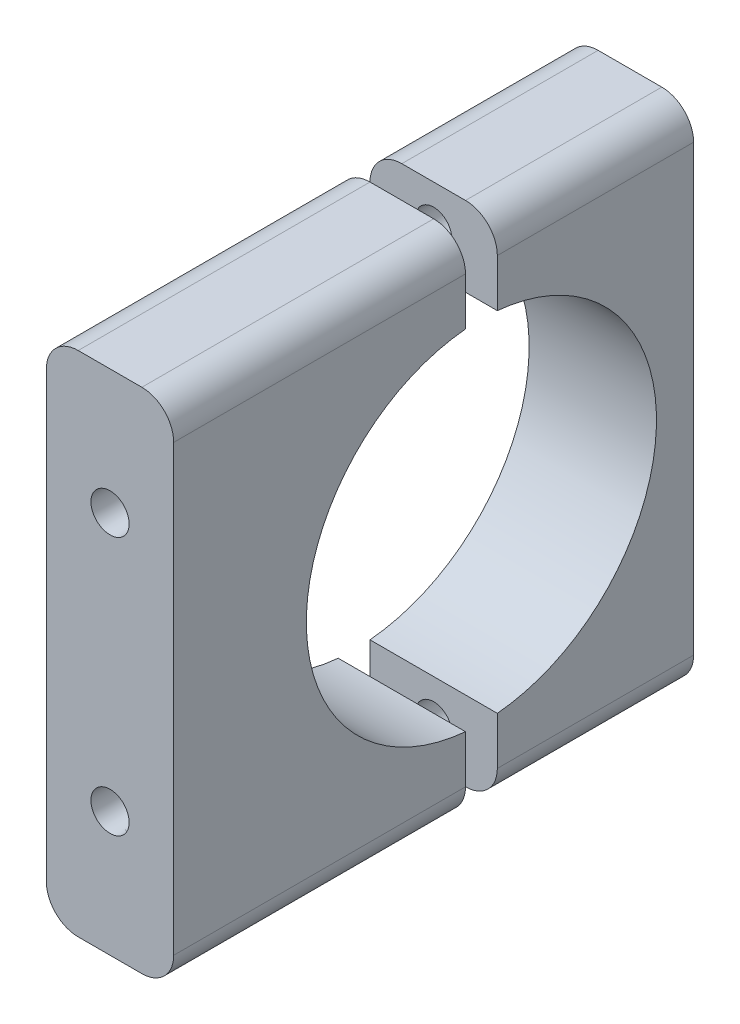
ISO-10303-21;
HEADER;
FILE_DESCRIPTION(('STEP AP214'),'2;1');
FILE_NAME('part.step','',(''),(''),'','','');
FILE_SCHEMA(('AUTOMOTIVE_DESIGN { 1 0 10303 214 1 1 1 1 }'));
ENDSEC;
DATA;
#1=APPLICATION_CONTEXT('core data for automotive mechanical design processes');
#2=APPLICATION_PROTOCOL_DEFINITION('international standard','automotive_design',2000,#1);
#3=PRODUCT_CONTEXT('',#1,'mechanical');
#4=PRODUCT('Part','Part','',(#3));
#5=PRODUCT_RELATED_PRODUCT_CATEGORY('part','',(#4));
#6=PRODUCT_DEFINITION_FORMATION('','',#4);
#7=PRODUCT_DEFINITION_CONTEXT('part definition',#1,'design');
#8=PRODUCT_DEFINITION('design','',#6,#7);
#9=PRODUCT_DEFINITION_SHAPE('','',#8);
#10=(LENGTH_UNIT() NAMED_UNIT(*) SI_UNIT(.MILLI.,.METRE.));
#11=(NAMED_UNIT(*) PLANE_ANGLE_UNIT() SI_UNIT($,.RADIAN.));
#12=(NAMED_UNIT(*) SI_UNIT($,.STERADIAN.) SOLID_ANGLE_UNIT());
#13=UNCERTAINTY_MEASURE_WITH_UNIT(LENGTH_MEASURE(1.E-05),#10,'distance_accuracy_value','');
#14=(GEOMETRIC_REPRESENTATION_CONTEXT(3) GLOBAL_UNCERTAINTY_ASSIGNED_CONTEXT((#13)) GLOBAL_UNIT_ASSIGNED_CONTEXT((#10,
#11,#12)) REPRESENTATION_CONTEXT('',''));
#15=CARTESIAN_POINT('',(0.,0.,0.));
#16=DIRECTION('',(0.,0.,1.));
#17=DIRECTION('',(1.,0.,0.));
#18=AXIS2_PLACEMENT_3D('',#15,#16,#17);
#19=CARTESIAN_POINT('',(12.,0.,1.5));
#20=DIRECTION('',(0.,0.,1.));
#21=DIRECTION('',(0.,-1.,0.));
#22=AXIS2_PLACEMENT_3D('',#19,#20,#21);
#23=PLANE('',#22);
#24=DIRECTION('',(0.,1.,0.));
#25=VECTOR('',#24,1.);
#26=CARTESIAN_POINT('',(12.,0.,1.5));
#27=LINE('',#26,#25);
#28=CARTESIAN_POINT('',(12.,-20.931676725155,1.5));
#29=VERTEX_POINT('',#28);
#30=CARTESIAN_POINT('',(12.,-16.431676725155,1.5));
#31=VERTEX_POINT('',#30);
#32=EDGE_CURVE('E156',#29,#31,#27,.T.);
#33=ORIENTED_EDGE('',*,*,#32,.F.);
#34=CARTESIAN_POINT('',(9.,-20.931676725155,1.5));
#35=DIRECTION('',(0.,0.,1.));
#36=DIRECTION('',(0.,-1.,0.));
#37=AXIS2_PLACEMENT_3D('',#34,#35,#36);
#38=CIRCLE('',#37,3.);
#39=CARTESIAN_POINT('',(9.,-23.931676725155,1.5));
#40=VERTEX_POINT('',#39);
#41=EDGE_CURVE('E74',#29,#40,#38,.F.);
#42=ORIENTED_EDGE('',*,*,#41,.T.);
#43=DIRECTION('',(-1.,0.,0.));
#44=VECTOR('',#43,1.);
#45=CARTESIAN_POINT('',(12.,-23.931676725155,1.5));
#46=LINE('',#45,#44);
#47=CARTESIAN_POINT('',(3.,-23.931676725155,1.5));
#48=VERTEX_POINT('',#47);
#49=EDGE_CURVE('E177',#40,#48,#46,.T.);
#50=ORIENTED_EDGE('',*,*,#49,.T.);
#51=CARTESIAN_POINT('',(3.,-20.931676725155,1.5));
#52=DIRECTION('',(0.,0.,1.));
#53=DIRECTION('',(0.,-1.,0.));
#54=AXIS2_PLACEMENT_3D('',#51,#52,#53);
#55=CIRCLE('',#54,3.);
#56=CARTESIAN_POINT('',(0.,-20.931676725155,1.5));
#57=VERTEX_POINT('',#56);
#58=EDGE_CURVE('E66',#48,#57,#55,.F.);
#59=ORIENTED_EDGE('',*,*,#58,.T.);
#60=DIRECTION('',(0.,1.,0.));
#61=VECTOR('',#60,1.);
#62=CARTESIAN_POINT('',(0.,0.,1.5));
#63=LINE('',#62,#61);
#64=CARTESIAN_POINT('',(0.,-16.431676725155,1.5));
#65=VERTEX_POINT('',#64);
#66=EDGE_CURVE('E158',#57,#65,#63,.T.);
#67=ORIENTED_EDGE('',*,*,#66,.T.);
#68=DIRECTION('',(-1.,0.,0.));
#69=VECTOR('',#68,1.);
#70=CARTESIAN_POINT('',(12.,-16.431676725155,1.5));
#71=LINE('',#70,#69);
#72=EDGE_CURVE('E169',#31,#65,#71,.T.);
#73=ORIENTED_EDGE('',*,*,#72,.F.);
#74=EDGE_LOOP('',(#33,#42,#50,#59,#67,#73));
#75=FACE_BOUND('',#74,.T.);
#76=CARTESIAN_POINT('',(6.,-20.181676725155,1.5));
#77=DIRECTION('',(0.,0.,-1.));
#78=DIRECTION('',(0.,1.,0.));
#79=AXIS2_PLACEMENT_3D('',#76,#77,#78);
#80=CIRCLE('',#79,1.80000000000001);
#81=CARTESIAN_POINT('',(6.,-18.381676725155,1.5));
#82=VERTEX_POINT('',#81);
#83=EDGE_CURVE('E163',#82,#82,#80,.T.);
#84=ORIENTED_EDGE('',*,*,#83,.F.);
#85=EDGE_LOOP('',(#84));
#86=FACE_BOUND('',#85,.T.);
#87=ADVANCED_FACE('F49',(#75,#86),#23,.F.);
#88=CARTESIAN_POINT('',(12.,0.,0.));
#89=DIRECTION('',(-1.,0.,0.));
#90=DIRECTION('',(0.,0.,1.));
#91=AXIS2_PLACEMENT_3D('',#88,#89,#90);
#92=CYLINDRICAL_SURFACE('',#91,16.5);
#93=CARTESIAN_POINT('',(0.,0.,0.));
#94=DIRECTION('',(1.,0.,0.));
#95=DIRECTION('',(0.,0.,-1.));
#96=AXIS2_PLACEMENT_3D('',#93,#94,#95);
#97=CIRCLE('',#96,16.5);
#98=CARTESIAN_POINT('',(0.,16.431676725155,1.5));
#99=VERTEX_POINT('',#98);
#100=EDGE_CURVE('E136',#99,#65,#97,.T.);
#101=ORIENTED_EDGE('',*,*,#100,.F.);
#102=DIRECTION('',(-1.,0.,0.));
#103=VECTOR('',#102,1.);
#104=CARTESIAN_POINT('',(12.,16.431676725155,1.5));
#105=LINE('',#104,#103);
#106=CARTESIAN_POINT('',(12.,16.431676725155,1.5));
#107=VERTEX_POINT('',#106);
#108=EDGE_CURVE('E129',#107,#99,#105,.T.);
#109=ORIENTED_EDGE('',*,*,#108,.F.);
#110=CARTESIAN_POINT('',(12.,0.,0.));
#111=DIRECTION('',(1.,0.,0.));
#112=DIRECTION('',(0.,0.,-1.));
#113=AXIS2_PLACEMENT_3D('',#110,#111,#112);
#114=CIRCLE('',#113,16.5);
#115=EDGE_CURVE('E134',#107,#31,#114,.T.);
#116=ORIENTED_EDGE('',*,*,#115,.T.);
#117=ORIENTED_EDGE('',*,*,#72,.T.);
#118=EDGE_LOOP('',(#101,#109,#116,#117));
#119=FACE_BOUND('',#118,.T.);
#120=ADVANCED_FACE('F131',(#119),#92,.F.);
#121=CARTESIAN_POINT('',(12.,0.,1.5));
#122=DIRECTION('',(0.,0.,1.));
#123=DIRECTION('',(0.,-1.,0.));
#124=AXIS2_PLACEMENT_3D('',#121,#122,#123);
#125=PLANE('',#124);
#126=CARTESIAN_POINT('',(6.,20.181676725155,1.5));
#127=DIRECTION('',(0.,0.,-1.));
#128=DIRECTION('',(0.,1.,0.));
#129=AXIS2_PLACEMENT_3D('',#126,#127,#128);
#130=CIRCLE('',#129,1.80000000000001);
#131=CARTESIAN_POINT('',(6.,21.981676725155,1.5));
#132=VERTEX_POINT('',#131);
#133=EDGE_CURVE('E217',#132,#132,#130,.T.);
#134=ORIENTED_EDGE('',*,*,#133,.F.);
#135=EDGE_LOOP('',(#134));
#136=FACE_BOUND('',#135,.T.);
#137=DIRECTION('',(-1.,0.,0.));
#138=VECTOR('',#137,1.);
#139=CARTESIAN_POINT('',(12.,23.931676725155,1.5));
#140=LINE('',#139,#138);
#141=CARTESIAN_POINT('',(9.,23.931676725155,1.5));
#142=VERTEX_POINT('',#141);
#143=CARTESIAN_POINT('',(3.,23.931676725155,1.5));
#144=VERTEX_POINT('',#143);
#145=EDGE_CURVE('E141',#142,#144,#140,.T.);
#146=ORIENTED_EDGE('',*,*,#145,.F.);
#147=CARTESIAN_POINT('',(9.,20.931676725155,1.5));
#148=DIRECTION('',(0.,0.,1.));
#149=DIRECTION('',(0.,-1.,0.));
#150=AXIS2_PLACEMENT_3D('',#147,#148,#149);
#151=CIRCLE('',#150,3.);
#152=CARTESIAN_POINT('',(12.,20.931676725155,1.5));
#153=VERTEX_POINT('',#152);
#154=EDGE_CURVE('E148',#142,#153,#151,.F.);
#155=ORIENTED_EDGE('',*,*,#154,.T.);
#156=DIRECTION('',(0.,1.,0.));
#157=VECTOR('',#156,1.);
#158=CARTESIAN_POINT('',(12.,0.,1.5));
#159=LINE('',#158,#157);
#160=EDGE_CURVE('E144',#107,#153,#159,.T.);
#161=ORIENTED_EDGE('',*,*,#160,.F.);
#162=ORIENTED_EDGE('',*,*,#108,.T.);
#163=DIRECTION('',(0.,1.,0.));
#164=VECTOR('',#163,1.);
#165=CARTESIAN_POINT('',(0.,0.,1.5));
#166=LINE('',#165,#164);
#167=CARTESIAN_POINT('',(0.,20.931676725155,1.5));
#168=VERTEX_POINT('',#167);
#169=EDGE_CURVE('E171',#99,#168,#166,.T.);
#170=ORIENTED_EDGE('',*,*,#169,.T.);
#171=CARTESIAN_POINT('',(3.,20.931676725155,1.5));
#172=DIRECTION('',(0.,0.,1.));
#173=DIRECTION('',(0.,-1.,0.));
#174=AXIS2_PLACEMENT_3D('',#171,#172,#173);
#175=CIRCLE('',#174,3.);
#176=EDGE_CURVE('E203',#168,#144,#175,.F.);
#177=ORIENTED_EDGE('',*,*,#176,.T.);
#178=EDGE_LOOP('',(#146,#155,#161,#162,#170,#177));
#179=FACE_BOUND('',#178,.T.);
#180=ADVANCED_FACE('F146',(#136,#179),#125,.F.);
#181=CARTESIAN_POINT('',(12.,23.931676725155,0.));
#182=DIRECTION('',(0.,-1.,0.));
#183=DIRECTION('',(0.,0.,-1.));
#184=AXIS2_PLACEMENT_3D('',#181,#182,#183);
#185=PLANE('',#184);
#186=DIRECTION('',(-1.,0.,0.));
#187=VECTOR('',#186,1.);
#188=CARTESIAN_POINT('',(12.,23.931676725155,29.));
#189=LINE('',#188,#187);
#190=CARTESIAN_POINT('',(9.,23.931676725155,29.));
#191=VERTEX_POINT('',#190);
#192=CARTESIAN_POINT('',(3.,23.931676725155,29.));
#193=VERTEX_POINT('',#192);
#194=EDGE_CURVE('E182',#191,#193,#189,.T.);
#195=ORIENTED_EDGE('',*,*,#194,.F.);
#196=DIRECTION('',(0.,0.,1.));
#197=VECTOR('',#196,1.);
#198=CARTESIAN_POINT('',(9.,23.931676725155,1.5));
#199=LINE('',#198,#197);
#200=EDGE_CURVE('E201',#191,#142,#199,.F.);
#201=ORIENTED_EDGE('',*,*,#200,.T.);
#202=ORIENTED_EDGE('',*,*,#145,.T.);
#203=DIRECTION('',(0.,0.,1.));
#204=VECTOR('',#203,1.);
#205=CARTESIAN_POINT('',(3.,23.931676725155,0.));
#206=LINE('',#205,#204);
#207=EDGE_CURVE('E198',#144,#193,#206,.T.);
#208=ORIENTED_EDGE('',*,*,#207,.T.);
#209=EDGE_LOOP('',(#195,#201,#202,#208));
#210=FACE_BOUND('',#209,.T.);
#211=ADVANCED_FACE('F239',(#210),#185,.F.);
#212=CARTESIAN_POINT('',(12.,0.,29.));
#213=DIRECTION('',(0.,0.,-1.));
#214=DIRECTION('',(-1.,0.,0.));
#215=AXIS2_PLACEMENT_3D('',#212,#213,#214);
#216=PLANE('',#215);
#217=CARTESIAN_POINT('',(6.,12.181676725155,29.));
#218=DIRECTION('',(0.,0.,1.));
#219=DIRECTION('',(1.,0.,0.));
#220=AXIS2_PLACEMENT_3D('',#217,#218,#219);
#221=CIRCLE('',#220,1.80000000000001);
#222=CARTESIAN_POINT('',(7.80000000000002,12.181676725155,29.));
#223=VERTEX_POINT('',#222);
#224=EDGE_CURVE('E229',#223,#223,#221,.T.);
#225=ORIENTED_EDGE('',*,*,#224,.F.);
#226=EDGE_LOOP('',(#225));
#227=FACE_BOUND('',#226,.T.);
#228=CARTESIAN_POINT('',(6.,-12.181676725155,29.));
#229=DIRECTION('',(0.,0.,1.));
#230=DIRECTION('',(1.,0.,0.));
#231=AXIS2_PLACEMENT_3D('',#228,#229,#230);
#232=CIRCLE('',#231,1.80000000000001);
#233=CARTESIAN_POINT('',(7.80000000000002,-12.181676725155,29.));
#234=VERTEX_POINT('',#233);
#235=EDGE_CURVE('E220',#234,#234,#232,.T.);
#236=ORIENTED_EDGE('',*,*,#235,.F.);
#237=EDGE_LOOP('',(#236));
#238=FACE_BOUND('',#237,.T.);
#239=DIRECTION('',(0.,-1.,0.));
#240=VECTOR('',#239,1.);
#241=CARTESIAN_POINT('',(12.,0.,29.));
#242=LINE('',#241,#240);
#243=CARTESIAN_POINT('',(12.,20.931676725155,29.));
#244=VERTEX_POINT('',#243);
#245=CARTESIAN_POINT('',(12.,-20.931676725155,29.));
#246=VERTEX_POINT('',#245);
#247=EDGE_CURVE('E152',#244,#246,#242,.T.);
#248=ORIENTED_EDGE('',*,*,#247,.F.);
#249=CARTESIAN_POINT('',(9.,20.931676725155,29.));
#250=DIRECTION('',(0.,0.,-1.));
#251=DIRECTION('',(-1.,0.,0.));
#252=AXIS2_PLACEMENT_3D('',#249,#250,#251);
#253=CIRCLE('',#252,3.);
#254=EDGE_CURVE('E196',#244,#191,#253,.F.);
#255=ORIENTED_EDGE('',*,*,#254,.T.);
#256=ORIENTED_EDGE('',*,*,#194,.T.);
#257=CARTESIAN_POINT('',(3.,20.931676725155,29.));
#258=DIRECTION('',(0.,0.,-1.));
#259=DIRECTION('',(-1.,0.,0.));
#260=AXIS2_PLACEMENT_3D('',#257,#258,#259);
#261=CIRCLE('',#260,3.);
#262=CARTESIAN_POINT('',(0.,20.931676725155,29.));
#263=VERTEX_POINT('',#262);
#264=EDGE_CURVE('E190',#193,#263,#261,.F.);
#265=ORIENTED_EDGE('',*,*,#264,.T.);
#266=DIRECTION('',(0.,-1.,0.));
#267=VECTOR('',#266,1.);
#268=CARTESIAN_POINT('',(0.,0.,29.));
#269=LINE('',#268,#267);
#270=CARTESIAN_POINT('',(0.,-20.931676725155,29.));
#271=VERTEX_POINT('',#270);
#272=EDGE_CURVE('E160',#263,#271,#269,.T.);
#273=ORIENTED_EDGE('',*,*,#272,.T.);
#274=CARTESIAN_POINT('',(3.,-20.931676725155,29.));
#275=DIRECTION('',(0.,0.,-1.));
#276=DIRECTION('',(-1.,0.,0.));
#277=AXIS2_PLACEMENT_3D('',#274,#275,#276);
#278=CIRCLE('',#277,3.);
#279=CARTESIAN_POINT('',(3.,-23.931676725155,29.));
#280=VERTEX_POINT('',#279);
#281=EDGE_CURVE('E192',#271,#280,#278,.F.);
#282=ORIENTED_EDGE('',*,*,#281,.T.);
#283=DIRECTION('',(-1.,0.,0.));
#284=VECTOR('',#283,1.);
#285=CARTESIAN_POINT('',(12.,-23.931676725155,29.));
#286=LINE('',#285,#284);
#287=CARTESIAN_POINT('',(9.,-23.931676725155,29.));
#288=VERTEX_POINT('',#287);
#289=EDGE_CURVE('E179',#288,#280,#286,.T.);
#290=ORIENTED_EDGE('',*,*,#289,.F.);
#291=CARTESIAN_POINT('',(9.,-20.931676725155,29.));
#292=DIRECTION('',(0.,0.,-1.));
#293=DIRECTION('',(-1.,0.,0.));
#294=AXIS2_PLACEMENT_3D('',#291,#292,#293);
#295=CIRCLE('',#294,3.);
#296=EDGE_CURVE('E194',#288,#246,#295,.F.);
#297=ORIENTED_EDGE('',*,*,#296,.T.);
#298=EDGE_LOOP('',(#248,#255,#256,#265,#273,#282,#290,#297));
#299=FACE_BOUND('',#298,.T.);
#300=ADVANCED_FACE('F235',(#227,#238,#299),#216,.F.);
#301=CARTESIAN_POINT('',(12.,-23.931676725155,0.));
#302=DIRECTION('',(0.,1.,0.));
#303=DIRECTION('',(0.,0.,1.));
#304=AXIS2_PLACEMENT_3D('',#301,#302,#303);
#305=PLANE('',#304);
#306=ORIENTED_EDGE('',*,*,#49,.F.);
#307=DIRECTION('',(0.,0.,-1.));
#308=VECTOR('',#307,1.);
#309=CARTESIAN_POINT('',(9.,-23.931676725155,29.));
#310=LINE('',#309,#308);
#311=EDGE_CURVE('E210',#40,#288,#310,.F.);
#312=ORIENTED_EDGE('',*,*,#311,.T.);
#313=ORIENTED_EDGE('',*,*,#289,.T.);
#314=DIRECTION('',(0.,0.,-1.));
#315=VECTOR('',#314,1.);
#316=CARTESIAN_POINT('',(3.,-23.931676725155,0.));
#317=LINE('',#316,#315);
#318=EDGE_CURVE('E208',#280,#48,#317,.T.);
#319=ORIENTED_EDGE('',*,*,#318,.T.);
#320=EDGE_LOOP('',(#306,#312,#313,#319));
#321=FACE_BOUND('',#320,.T.);
#322=ADVANCED_FACE('F238',(#321),#305,.F.);
#323=CARTESIAN_POINT('',(12.,0.,0.));
#324=DIRECTION('',(1.,0.,0.));
#325=DIRECTION('',(0.,0.,-1.));
#326=AXIS2_PLACEMENT_3D('',#323,#324,#325);
#327=PLANE('',#326);
#328=ORIENTED_EDGE('',*,*,#160,.T.);
#329=DIRECTION('',(0.,0.,1.));
#330=VECTOR('',#329,1.);
#331=CARTESIAN_POINT('',(12.,20.931676725155,29.));
#332=LINE('',#331,#330);
#333=EDGE_CURVE('E188',#153,#244,#332,.T.);
#334=ORIENTED_EDGE('',*,*,#333,.T.);
#335=ORIENTED_EDGE('',*,*,#247,.T.);
#336=DIRECTION('',(0.,0.,-1.));
#337=VECTOR('',#336,1.);
#338=CARTESIAN_POINT('',(12.,-20.931676725155,1.5));
#339=LINE('',#338,#337);
#340=EDGE_CURVE('E140',#246,#29,#339,.T.);
#341=ORIENTED_EDGE('',*,*,#340,.T.);
#342=ORIENTED_EDGE('',*,*,#32,.T.);
#343=ORIENTED_EDGE('',*,*,#115,.F.);
#344=EDGE_LOOP('',(#328,#334,#335,#341,#342,#343));
#345=FACE_BOUND('',#344,.T.);
#346=ADVANCED_FACE('F154',(#345),#327,.T.);
#347=CARTESIAN_POINT('',(0.,0.,0.));
#348=DIRECTION('',(1.,0.,0.));
#349=DIRECTION('',(0.,0.,-1.));
#350=AXIS2_PLACEMENT_3D('',#347,#348,#349);
#351=PLANE('',#350);
#352=ORIENTED_EDGE('',*,*,#66,.F.);
#353=DIRECTION('',(0.,0.,-1.));
#354=VECTOR('',#353,1.);
#355=CARTESIAN_POINT('',(0.,-20.931676725155,0.));
#356=LINE('',#355,#354);
#357=EDGE_CURVE('E12',#57,#271,#356,.F.);
#358=ORIENTED_EDGE('',*,*,#357,.T.);
#359=ORIENTED_EDGE('',*,*,#272,.F.);
#360=DIRECTION('',(0.,0.,1.));
#361=VECTOR('',#360,1.);
#362=CARTESIAN_POINT('',(0.,20.931676725155,0.));
#363=LINE('',#362,#361);
#364=EDGE_CURVE('E58',#263,#168,#363,.F.);
#365=ORIENTED_EDGE('',*,*,#364,.T.);
#366=ORIENTED_EDGE('',*,*,#169,.F.);
#367=ORIENTED_EDGE('',*,*,#100,.T.);
#368=EDGE_LOOP('',(#352,#358,#359,#365,#366,#367));
#369=FACE_BOUND('',#368,.T.);
#370=ADVANCED_FACE('F257',(#369),#351,.F.);
#371=CARTESIAN_POINT('',(9.,20.931676725155,0.));
#372=DIRECTION('',(0.,0.,-1.));
#373=DIRECTION('',(-1.,0.,0.));
#374=AXIS2_PLACEMENT_3D('',#371,#372,#373);
#375=CYLINDRICAL_SURFACE('',#374,3.);
#376=ORIENTED_EDGE('',*,*,#154,.F.);
#377=ORIENTED_EDGE('',*,*,#200,.F.);
#378=ORIENTED_EDGE('',*,*,#254,.F.);
#379=ORIENTED_EDGE('',*,*,#333,.F.);
#380=EDGE_LOOP('',(#376,#377,#378,#379));
#381=FACE_BOUND('',#380,.T.);
#382=ADVANCED_FACE('F266',(#381),#375,.T.);
#383=CARTESIAN_POINT('',(9.,-20.931676725155,0.));
#384=DIRECTION('',(0.,0.,1.));
#385=DIRECTION('',(1.,0.,0.));
#386=AXIS2_PLACEMENT_3D('',#383,#384,#385);
#387=CYLINDRICAL_SURFACE('',#386,3.);
#388=ORIENTED_EDGE('',*,*,#296,.F.);
#389=ORIENTED_EDGE('',*,*,#311,.F.);
#390=ORIENTED_EDGE('',*,*,#41,.F.);
#391=ORIENTED_EDGE('',*,*,#340,.F.);
#392=EDGE_LOOP('',(#388,#389,#390,#391));
#393=FACE_BOUND('',#392,.T.);
#394=ADVANCED_FACE('F248',(#393),#387,.T.);
#395=CARTESIAN_POINT('',(3.,-20.931676725155,0.));
#396=DIRECTION('',(0.,0.,-1.));
#397=DIRECTION('',(-1.,0.,0.));
#398=AXIS2_PLACEMENT_3D('',#395,#396,#397);
#399=CYLINDRICAL_SURFACE('',#398,3.);
#400=ORIENTED_EDGE('',*,*,#281,.F.);
#401=ORIENTED_EDGE('',*,*,#357,.F.);
#402=ORIENTED_EDGE('',*,*,#58,.F.);
#403=ORIENTED_EDGE('',*,*,#318,.F.);
#404=EDGE_LOOP('',(#400,#401,#402,#403));
#405=FACE_BOUND('',#404,.T.);
#406=ADVANCED_FACE('F253',(#405),#399,.T.);
#407=CARTESIAN_POINT('',(3.,20.931676725155,0.));
#408=DIRECTION('',(0.,0.,1.));
#409=DIRECTION('',(1.,0.,0.));
#410=AXIS2_PLACEMENT_3D('',#407,#408,#409);
#411=CYLINDRICAL_SURFACE('',#410,3.);
#412=ORIENTED_EDGE('',*,*,#176,.F.);
#413=ORIENTED_EDGE('',*,*,#364,.F.);
#414=ORIENTED_EDGE('',*,*,#264,.F.);
#415=ORIENTED_EDGE('',*,*,#207,.F.);
#416=EDGE_LOOP('',(#412,#413,#414,#415));
#417=FACE_BOUND('',#416,.T.);
#418=ADVANCED_FACE('F262',(#417),#411,.T.);
#419=CARTESIAN_POINT('',(6.,-20.181676725155,7.5));
#420=DIRECTION('',(0.,0.,1.));
#421=DIRECTION('',(0.,-1.,0.));
#422=AXIS2_PLACEMENT_3D('',#419,#420,#421);
#423=PLANE('',#422);
#424=CARTESIAN_POINT('',(6.,-20.181676725155,7.5));
#425=DIRECTION('',(0.,0.,1.));
#426=DIRECTION('',(0.,-1.,0.));
#427=AXIS2_PLACEMENT_3D('',#424,#425,#426);
#428=CIRCLE('',#427,1.59047538304953);
#429=CARTESIAN_POINT('',(6.,-21.7721521082045,7.5));
#430=VERTEX_POINT('',#429);
#431=EDGE_CURVE('E172',#430,#430,#428,.F.);
#432=ORIENTED_EDGE('',*,*,#431,.T.);
#433=EDGE_LOOP('',(#432));
#434=FACE_BOUND('',#433,.T.);
#435=ADVANCED_FACE('F326',(#434),#423,.F.);
#436=CARTESIAN_POINT('',(6.,-20.181676725155,1.5));
#437=DIRECTION('',(0.,0.,-1.));
#438=DIRECTION('',(0.,1.,0.));
#439=AXIS2_PLACEMENT_3D('',#436,#437,#438);
#440=CONICAL_SURFACE('',#439,1.80000000000001,0.0349065850398866);
#441=ORIENTED_EDGE('',*,*,#431,.F.);
#442=EDGE_LOOP('',(#441));
#443=FACE_BOUND('',#442,.T.);
#444=ORIENTED_EDGE('',*,*,#83,.T.);
#445=EDGE_LOOP('',(#444));
#446=FACE_BOUND('',#445,.T.);
#447=ADVANCED_FACE('F307',(#443,#446),#440,.F.);
#448=CARTESIAN_POINT('',(6.,20.181676725155,7.5));
#449=DIRECTION('',(0.,0.,1.));
#450=DIRECTION('',(0.,-1.,0.));
#451=AXIS2_PLACEMENT_3D('',#448,#449,#450);
#452=PLANE('',#451);
#453=CARTESIAN_POINT('',(6.,20.181676725155,7.5));
#454=DIRECTION('',(0.,0.,1.));
#455=DIRECTION('',(0.,-1.,0.));
#456=AXIS2_PLACEMENT_3D('',#453,#454,#455);
#457=CIRCLE('',#456,1.59047538304953);
#458=CARTESIAN_POINT('',(6.,18.5912013421055,7.5));
#459=VERTEX_POINT('',#458);
#460=EDGE_CURVE('E215',#459,#459,#457,.F.);
#461=ORIENTED_EDGE('',*,*,#460,.T.);
#462=EDGE_LOOP('',(#461));
#463=FACE_BOUND('',#462,.T.);
#464=ADVANCED_FACE('F298',(#463),#452,.F.);
#465=CARTESIAN_POINT('',(6.,20.181676725155,1.5));
#466=DIRECTION('',(0.,0.,-1.));
#467=DIRECTION('',(0.,1.,0.));
#468=AXIS2_PLACEMENT_3D('',#465,#466,#467);
#469=CONICAL_SURFACE('',#468,1.80000000000001,0.0349065850398866);
#470=ORIENTED_EDGE('',*,*,#460,.F.);
#471=EDGE_LOOP('',(#470));
#472=FACE_BOUND('',#471,.T.);
#473=ORIENTED_EDGE('',*,*,#133,.T.);
#474=EDGE_LOOP('',(#473));
#475=FACE_BOUND('',#474,.T.);
#476=ADVANCED_FACE('F295',(#472,#475),#469,.F.);
#477=CARTESIAN_POINT('',(6.,-12.181676725155,23.));
#478=DIRECTION('',(0.,0.,-1.));
#479=DIRECTION('',(-1.,0.,0.));
#480=AXIS2_PLACEMENT_3D('',#477,#478,#479);
#481=PLANE('',#480);
#482=CARTESIAN_POINT('',(6.,-12.181676725155,23.));
#483=DIRECTION('',(0.,0.,-1.));
#484=DIRECTION('',(-1.,0.,0.));
#485=AXIS2_PLACEMENT_3D('',#482,#483,#484);
#486=CIRCLE('',#485,1.59047538304953);
#487=CARTESIAN_POINT('',(4.40952461695048,-12.181676725155,23.));
#488=VERTEX_POINT('',#487);
#489=EDGE_CURVE('E218',#488,#488,#486,.F.);
#490=ORIENTED_EDGE('',*,*,#489,.T.);
#491=EDGE_LOOP('',(#490));
#492=FACE_BOUND('',#491,.T.);
#493=ADVANCED_FACE('F297',(#492),#481,.F.);
#494=CARTESIAN_POINT('',(6.,-12.181676725155,29.));
#495=DIRECTION('',(0.,0.,1.));
#496=DIRECTION('',(1.,0.,0.));
#497=AXIS2_PLACEMENT_3D('',#494,#495,#496);
#498=CONICAL_SURFACE('',#497,1.80000000000001,0.0349065850398866);
#499=ORIENTED_EDGE('',*,*,#489,.F.);
#500=EDGE_LOOP('',(#499));
#501=FACE_BOUND('',#500,.T.);
#502=ORIENTED_EDGE('',*,*,#235,.T.);
#503=EDGE_LOOP('',(#502));
#504=FACE_BOUND('',#503,.T.);
#505=ADVANCED_FACE('F305',(#501,#504),#498,.F.);
#506=CARTESIAN_POINT('',(6.,12.181676725155,23.));
#507=DIRECTION('',(0.,0.,-1.));
#508=DIRECTION('',(-1.,0.,0.));
#509=AXIS2_PLACEMENT_3D('',#506,#507,#508);
#510=PLANE('',#509);
#511=CARTESIAN_POINT('',(6.,12.181676725155,23.));
#512=DIRECTION('',(0.,0.,-1.));
#513=DIRECTION('',(-1.,0.,0.));
#514=AXIS2_PLACEMENT_3D('',#511,#512,#513);
#515=CIRCLE('',#514,1.59047538304953);
#516=CARTESIAN_POINT('',(4.40952461695048,12.181676725155,23.));
#517=VERTEX_POINT('',#516);
#518=EDGE_CURVE('E53',#517,#517,#515,.F.);
#519=ORIENTED_EDGE('',*,*,#518,.T.);
#520=EDGE_LOOP('',(#519));
#521=FACE_BOUND('',#520,.T.);
#522=ADVANCED_FACE('F314',(#521),#510,.F.);
#523=CARTESIAN_POINT('',(6.,12.181676725155,29.));
#524=DIRECTION('',(0.,0.,1.));
#525=DIRECTION('',(1.,0.,0.));
#526=AXIS2_PLACEMENT_3D('',#523,#524,#525);
#527=CONICAL_SURFACE('',#526,1.80000000000001,0.0349065850398866);
#528=ORIENTED_EDGE('',*,*,#518,.F.);
#529=EDGE_LOOP('',(#528));
#530=FACE_BOUND('',#529,.T.);
#531=ORIENTED_EDGE('',*,*,#224,.T.);
#532=EDGE_LOOP('',(#531));
#533=FACE_BOUND('',#532,.T.);
#534=ADVANCED_FACE('F51',(#530,#533),#527,.F.);
#535=CLOSED_SHELL('',(#87,#120,#180,#211,#300,#322,#346,#370,#382,#394,#406,#418,#435,#447,#464,
#476,#493,#505,#522,#534));
#536=MANIFOLD_SOLID_BREP('B2',#535);
#537=CARTESIAN_POINT('',(12.,0.,0.));
#538=DIRECTION('',(-1.,0.,0.));
#539=DIRECTION('',(0.,0.,1.));
#540=AXIS2_PLACEMENT_3D('',#537,#538,#539);
#541=CYLINDRICAL_SURFACE('',#540,16.5);
#542=CARTESIAN_POINT('',(0.,0.,0.));
#543=DIRECTION('',(1.,0.,0.));
#544=DIRECTION('',(0.,0.,-1.));
#545=AXIS2_PLACEMENT_3D('',#542,#543,#544);
#546=CIRCLE('',#545,16.5);
#547=CARTESIAN_POINT('',(0.,-16.431676725155,-1.5));
#548=VERTEX_POINT('',#547);
#549=CARTESIAN_POINT('',(0.,16.431676725155,-1.5));
#550=VERTEX_POINT('',#549);
#551=EDGE_CURVE('E573',#548,#550,#546,.T.);
#552=ORIENTED_EDGE('',*,*,#551,.F.);
#553=DIRECTION('',(-1.,0.,0.));
#554=VECTOR('',#553,1.);
#555=CARTESIAN_POINT('',(12.,-16.431676725155,-1.5));
#556=LINE('',#555,#554);
#557=CARTESIAN_POINT('',(12.,-16.431676725155,-1.5));
#558=VERTEX_POINT('',#557);
#559=EDGE_CURVE('E567',#558,#548,#556,.T.);
#560=ORIENTED_EDGE('',*,*,#559,.F.);
#561=CARTESIAN_POINT('',(12.,0.,0.));
#562=DIRECTION('',(1.,0.,0.));
#563=DIRECTION('',(0.,0.,-1.));
#564=AXIS2_PLACEMENT_3D('',#561,#562,#563);
#565=CIRCLE('',#564,16.5);
#566=CARTESIAN_POINT('',(12.,16.431676725155,-1.5));
#567=VERTEX_POINT('',#566);
#568=EDGE_CURVE('E571',#558,#567,#565,.T.);
#569=ORIENTED_EDGE('',*,*,#568,.T.);
#570=DIRECTION('',(-1.,0.,0.));
#571=VECTOR('',#570,1.);
#572=CARTESIAN_POINT('',(12.,16.431676725155,-1.5));
#573=LINE('',#572,#571);
#574=EDGE_CURVE('E606',#567,#550,#573,.T.);
#575=ORIENTED_EDGE('',*,*,#574,.T.);
#576=EDGE_LOOP('',(#552,#560,#569,#575));
#577=FACE_BOUND('',#576,.T.);
#578=ADVANCED_FACE('F489',(#577),#541,.F.);
#579=CARTESIAN_POINT('',(12.,0.,-1.50000000000001));
#580=DIRECTION('',(0.,0.,-1.));
#581=DIRECTION('',(0.,1.,0.));
#582=AXIS2_PLACEMENT_3D('',#579,#580,#581);
#583=PLANE('',#582);
#584=CARTESIAN_POINT('',(6.,-20.181676725155,-1.5));
#585=DIRECTION('',(0.,0.,-1.));
#586=DIRECTION('',(0.,1.,0.));
#587=AXIS2_PLACEMENT_3D('',#584,#585,#586);
#588=CIRCLE('',#587,1.7);
#589=CARTESIAN_POINT('',(6.,-18.481676725155,-1.5));
#590=VERTEX_POINT('',#589);
#591=EDGE_CURVE('E609',#590,#590,#588,.T.);
#592=ORIENTED_EDGE('',*,*,#591,.T.);
#593=EDGE_LOOP('',(#592));
#594=FACE_BOUND('',#593,.T.);
#595=DIRECTION('',(0.,-1.,0.));
#596=VECTOR('',#595,1.);
#597=CARTESIAN_POINT('',(0.,0.,-1.50000000000001));
#598=LINE('',#597,#596);
#599=CARTESIAN_POINT('',(0.,-20.931676725155,-1.5));
#600=VERTEX_POINT('',#599);
#601=EDGE_CURVE('E608',#548,#600,#598,.T.);
#602=ORIENTED_EDGE('',*,*,#601,.T.);
#603=CARTESIAN_POINT('',(3.,-20.931676725155,-1.5));
#604=DIRECTION('',(0.,0.,-1.));
#605=DIRECTION('',(0.,1.,0.));
#606=AXIS2_PLACEMENT_3D('',#603,#604,#605);
#607=CIRCLE('',#606,3.);
#608=CARTESIAN_POINT('',(3.,-23.931676725155,-1.5));
#609=VERTEX_POINT('',#608);
#610=EDGE_CURVE('E641',#600,#609,#607,.F.);
#611=ORIENTED_EDGE('',*,*,#610,.T.);
#612=DIRECTION('',(-1.,0.,0.));
#613=VECTOR('',#612,1.);
#614=CARTESIAN_POINT('',(12.,-23.931676725155,-1.5));
#615=LINE('',#614,#613);
#616=CARTESIAN_POINT('',(9.,-23.931676725155,-1.5));
#617=VERTEX_POINT('',#616);
#618=EDGE_CURVE('E578',#617,#609,#615,.T.);
#619=ORIENTED_EDGE('',*,*,#618,.F.);
#620=CARTESIAN_POINT('',(9.,-20.931676725155,-1.5));
#621=DIRECTION('',(0.,0.,-1.));
#622=DIRECTION('',(0.,1.,0.));
#623=AXIS2_PLACEMENT_3D('',#620,#621,#622);
#624=CIRCLE('',#623,3.);
#625=CARTESIAN_POINT('',(12.,-20.931676725155,-1.5));
#626=VERTEX_POINT('',#625);
#627=EDGE_CURVE('E585',#617,#626,#624,.F.);
#628=ORIENTED_EDGE('',*,*,#627,.T.);
#629=DIRECTION('',(0.,-1.,0.));
#630=VECTOR('',#629,1.);
#631=CARTESIAN_POINT('',(12.,0.,-1.50000000000001));
#632=LINE('',#631,#630);
#633=EDGE_CURVE('E581',#558,#626,#632,.T.);
#634=ORIENTED_EDGE('',*,*,#633,.F.);
#635=ORIENTED_EDGE('',*,*,#559,.T.);
#636=EDGE_LOOP('',(#602,#611,#619,#628,#634,#635));
#637=FACE_BOUND('',#636,.T.);
#638=ADVANCED_FACE('F582',(#594,#637),#583,.F.);
#639=CARTESIAN_POINT('',(12.,-23.931676725155,0.));
#640=DIRECTION('',(0.,1.,0.));
#641=DIRECTION('',(0.,0.,1.));
#642=AXIS2_PLACEMENT_3D('',#639,#640,#641);
#643=PLANE('',#642);
#644=ORIENTED_EDGE('',*,*,#618,.T.);
#645=DIRECTION('',(0.,0.,-1.));
#646=VECTOR('',#645,1.);
#647=CARTESIAN_POINT('',(3.,-23.931676725155,0.));
#648=LINE('',#647,#646);
#649=CARTESIAN_POINT('',(3.,-23.931676725155,-20.0000000000001));
#650=VERTEX_POINT('',#649);
#651=EDGE_CURVE('E625',#609,#650,#648,.T.);
#652=ORIENTED_EDGE('',*,*,#651,.T.);
#653=DIRECTION('',(-1.,0.,0.));
#654=VECTOR('',#653,1.);
#655=CARTESIAN_POINT('',(12.,-23.931676725155,-20.0000000000001));
#656=LINE('',#655,#654);
#657=CARTESIAN_POINT('',(9.,-23.931676725155,-20.0000000000001));
#658=VERTEX_POINT('',#657);
#659=EDGE_CURVE('E619',#658,#650,#656,.T.);
#660=ORIENTED_EDGE('',*,*,#659,.F.);
#661=DIRECTION('',(0.,0.,-1.));
#662=VECTOR('',#661,1.);
#663=CARTESIAN_POINT('',(9.,-23.931676725155,-1.5));
#664=LINE('',#663,#662);
#665=EDGE_CURVE('E577',#658,#617,#664,.F.);
#666=ORIENTED_EDGE('',*,*,#665,.T.);
#667=EDGE_LOOP('',(#644,#652,#660,#666));
#668=FACE_BOUND('',#667,.T.);
#669=ADVANCED_FACE('F715',(#668),#643,.F.);
#670=CARTESIAN_POINT('',(12.,0.,-20.0000000000001));
#671=DIRECTION('',(0.,0.,1.));
#672=DIRECTION('',(1.,0.,0.));
#673=AXIS2_PLACEMENT_3D('',#670,#671,#672);
#674=PLANE('',#673);
#675=CARTESIAN_POINT('',(6.,12.181676725155,-20.0000000000001));
#676=DIRECTION('',(0.,0.,-1.));
#677=DIRECTION('',(-1.,0.,0.));
#678=AXIS2_PLACEMENT_3D('',#675,#676,#677);
#679=CIRCLE('',#678,1.80000000000001);
#680=CARTESIAN_POINT('',(4.19999999999999,12.181676725155,-20.0000000000001));
#681=VERTEX_POINT('',#680);
#682=EDGE_CURVE('E672',#681,#681,#679,.T.);
#683=ORIENTED_EDGE('',*,*,#682,.F.);
#684=EDGE_LOOP('',(#683));
#685=FACE_BOUND('',#684,.T.);
#686=CARTESIAN_POINT('',(6.,-12.181676725155,-20.0000000000001));
#687=DIRECTION('',(0.,0.,-1.));
#688=DIRECTION('',(-1.,0.,0.));
#689=AXIS2_PLACEMENT_3D('',#686,#687,#688);
#690=CIRCLE('',#689,1.80000000000001);
#691=CARTESIAN_POINT('',(4.19999999999999,-12.181676725155,-20.0000000000001));
#692=VERTEX_POINT('',#691);
#693=EDGE_CURVE('E661',#692,#692,#690,.T.);
#694=ORIENTED_EDGE('',*,*,#693,.F.);
#695=EDGE_LOOP('',(#694));
#696=FACE_BOUND('',#695,.T.);
#697=CARTESIAN_POINT('',(6.,20.181676725155,-20.0000000000001));
#698=DIRECTION('',(0.,0.,-1.));
#699=DIRECTION('',(-1.,0.,0.));
#700=AXIS2_PLACEMENT_3D('',#697,#698,#699);
#701=CIRCLE('',#700,3.275);
#702=CARTESIAN_POINT('',(2.725,20.181676725155,-20.0000000000001));
#703=VERTEX_POINT('',#702);
#704=EDGE_CURVE('E660',#703,#703,#701,.T.);
#705=ORIENTED_EDGE('',*,*,#704,.F.);
#706=EDGE_LOOP('',(#705));
#707=FACE_BOUND('',#706,.T.);
#708=CARTESIAN_POINT('',(6.,-20.181676725155,-20.0000000000001));
#709=DIRECTION('',(0.,0.,-1.));
#710=DIRECTION('',(-1.,0.,0.));
#711=AXIS2_PLACEMENT_3D('',#708,#709,#710);
#712=CIRCLE('',#711,3.275);
#713=CARTESIAN_POINT('',(2.725,-20.181676725155,-20.0000000000001));
#714=VERTEX_POINT('',#713);
#715=EDGE_CURVE('E656',#714,#714,#712,.T.);
#716=ORIENTED_EDGE('',*,*,#715,.F.);
#717=EDGE_LOOP('',(#716));
#718=FACE_BOUND('',#717,.T.);
#719=ORIENTED_EDGE('',*,*,#659,.T.);
#720=CARTESIAN_POINT('',(3.,-20.931676725155,-20.0000000000001));
#721=DIRECTION('',(0.,0.,1.));
#722=DIRECTION('',(1.,0.,0.));
#723=AXIS2_PLACEMENT_3D('',#720,#721,#722);
#724=CIRCLE('',#723,3.);
#725=CARTESIAN_POINT('',(0.,-20.931676725155,-20.0000000000001));
#726=VERTEX_POINT('',#725);
#727=EDGE_CURVE('E634',#650,#726,#724,.F.);
#728=ORIENTED_EDGE('',*,*,#727,.T.);
#729=DIRECTION('',(0.,1.,0.));
#730=VECTOR('',#729,1.);
#731=CARTESIAN_POINT('',(0.,0.,-20.0000000000001));
#732=LINE('',#731,#730);
#733=CARTESIAN_POINT('',(0.,20.931676725155,-20.0000000000001));
#734=VERTEX_POINT('',#733);
#735=EDGE_CURVE('E597',#726,#734,#732,.T.);
#736=ORIENTED_EDGE('',*,*,#735,.T.);
#737=CARTESIAN_POINT('',(3.,20.931676725155,-20.0000000000001));
#738=DIRECTION('',(0.,0.,1.));
#739=DIRECTION('',(1.,0.,0.));
#740=AXIS2_PLACEMENT_3D('',#737,#738,#739);
#741=CIRCLE('',#740,3.);
#742=CARTESIAN_POINT('',(3.,23.931676725155,-20.0000000000001));
#743=VERTEX_POINT('',#742);
#744=EDGE_CURVE('E630',#734,#743,#741,.F.);
#745=ORIENTED_EDGE('',*,*,#744,.T.);
#746=DIRECTION('',(-1.,0.,0.));
#747=VECTOR('',#746,1.);
#748=CARTESIAN_POINT('',(12.,23.931676725155,-20.0000000000001));
#749=LINE('',#748,#747);
#750=CARTESIAN_POINT('',(9.,23.931676725155,-20.0000000000001));
#751=VERTEX_POINT('',#750);
#752=EDGE_CURVE('E616',#751,#743,#749,.T.);
#753=ORIENTED_EDGE('',*,*,#752,.F.);
#754=CARTESIAN_POINT('',(9.,20.931676725155,-20.0000000000001));
#755=DIRECTION('',(0.,0.,1.));
#756=DIRECTION('',(1.,0.,0.));
#757=AXIS2_PLACEMENT_3D('',#754,#755,#756);
#758=CIRCLE('',#757,3.);
#759=CARTESIAN_POINT('',(12.,20.931676725155,-20.0000000000001));
#760=VERTEX_POINT('',#759);
#761=EDGE_CURVE('E628',#751,#760,#758,.F.);
#762=ORIENTED_EDGE('',*,*,#761,.T.);
#763=DIRECTION('',(0.,1.,0.));
#764=VECTOR('',#763,1.);
#765=CARTESIAN_POINT('',(12.,0.,-20.0000000000001));
#766=LINE('',#765,#764);
#767=CARTESIAN_POINT('',(12.,-20.931676725155,-20.0000000000001));
#768=VERTEX_POINT('',#767);
#769=EDGE_CURVE('E589',#768,#760,#766,.T.);
#770=ORIENTED_EDGE('',*,*,#769,.F.);
#771=CARTESIAN_POINT('',(9.,-20.931676725155,-20.0000000000001));
#772=DIRECTION('',(0.,0.,1.));
#773=DIRECTION('',(1.,0.,0.));
#774=AXIS2_PLACEMENT_3D('',#771,#772,#773);
#775=CIRCLE('',#774,3.);
#776=EDGE_CURVE('E632',#768,#658,#775,.F.);
#777=ORIENTED_EDGE('',*,*,#776,.T.);
#778=EDGE_LOOP('',(#719,#728,#736,#745,#753,#762,#770,#777));
#779=FACE_BOUND('',#778,.T.);
#780=ADVANCED_FACE('F773',(#685,#696,#707,#718,#779),#674,.F.);
#781=CARTESIAN_POINT('',(12.,23.931676725155,0.));
#782=DIRECTION('',(0.,-1.,0.));
#783=DIRECTION('',(0.,0.,-1.));
#784=AXIS2_PLACEMENT_3D('',#781,#782,#783);
#785=PLANE('',#784);
#786=ORIENTED_EDGE('',*,*,#752,.T.);
#787=DIRECTION('',(0.,0.,1.));
#788=VECTOR('',#787,1.);
#789=CARTESIAN_POINT('',(3.,23.931676725155,0.));
#790=LINE('',#789,#788);
#791=CARTESIAN_POINT('',(3.,23.931676725155,-1.5));
#792=VERTEX_POINT('',#791);
#793=EDGE_CURVE('E649',#743,#792,#790,.T.);
#794=ORIENTED_EDGE('',*,*,#793,.T.);
#795=DIRECTION('',(-1.,0.,0.));
#796=VECTOR('',#795,1.);
#797=CARTESIAN_POINT('',(12.,23.931676725155,-1.5));
#798=LINE('',#797,#796);
#799=CARTESIAN_POINT('',(9.,23.931676725155,-1.5));
#800=VERTEX_POINT('',#799);
#801=EDGE_CURVE('E614',#800,#792,#798,.T.);
#802=ORIENTED_EDGE('',*,*,#801,.F.);
#803=DIRECTION('',(0.,0.,1.));
#804=VECTOR('',#803,1.);
#805=CARTESIAN_POINT('',(9.,23.931676725155,-20.0000000000001));
#806=LINE('',#805,#804);
#807=EDGE_CURVE('E647',#800,#751,#806,.F.);
#808=ORIENTED_EDGE('',*,*,#807,.T.);
#809=EDGE_LOOP('',(#786,#794,#802,#808));
#810=FACE_BOUND('',#809,.T.);
#811=ADVANCED_FACE('F776',(#810),#785,.F.);
#812=CARTESIAN_POINT('',(12.,0.,-1.50000000000001));
#813=DIRECTION('',(0.,0.,-1.));
#814=DIRECTION('',(0.,1.,0.));
#815=AXIS2_PLACEMENT_3D('',#812,#813,#814);
#816=PLANE('',#815);
#817=CARTESIAN_POINT('',(6.,20.181676725155,-1.5));
#818=DIRECTION('',(0.,0.,-1.));
#819=DIRECTION('',(0.,1.,0.));
#820=AXIS2_PLACEMENT_3D('',#817,#818,#819);
#821=CIRCLE('',#820,1.7);
#822=CARTESIAN_POINT('',(6.,21.881676725155,-1.5));
#823=VERTEX_POINT('',#822);
#824=EDGE_CURVE('E654',#823,#823,#821,.T.);
#825=ORIENTED_EDGE('',*,*,#824,.T.);
#826=EDGE_LOOP('',(#825));
#827=FACE_BOUND('',#826,.T.);
#828=ORIENTED_EDGE('',*,*,#801,.T.);
#829=CARTESIAN_POINT('',(3.,20.931676725155,-1.5));
#830=DIRECTION('',(0.,0.,-1.));
#831=DIRECTION('',(0.,1.,0.));
#832=AXIS2_PLACEMENT_3D('',#829,#830,#831);
#833=CIRCLE('',#832,3.);
#834=CARTESIAN_POINT('',(0.,20.931676725155,-1.5));
#835=VERTEX_POINT('',#834);
#836=EDGE_CURVE('E47',#792,#835,#833,.F.);
#837=ORIENTED_EDGE('',*,*,#836,.T.);
#838=DIRECTION('',(0.,-1.,0.));
#839=VECTOR('',#838,1.);
#840=CARTESIAN_POINT('',(0.,0.,-1.50000000000001));
#841=LINE('',#840,#839);
#842=EDGE_CURVE('E595',#835,#550,#841,.T.);
#843=ORIENTED_EDGE('',*,*,#842,.T.);
#844=ORIENTED_EDGE('',*,*,#574,.F.);
#845=DIRECTION('',(0.,-1.,0.));
#846=VECTOR('',#845,1.);
#847=CARTESIAN_POINT('',(12.,0.,-1.50000000000001));
#848=LINE('',#847,#846);
#849=CARTESIAN_POINT('',(12.,20.931676725155,-1.5));
#850=VERTEX_POINT('',#849);
#851=EDGE_CURVE('E593',#850,#567,#848,.T.);
#852=ORIENTED_EDGE('',*,*,#851,.F.);
#853=CARTESIAN_POINT('',(9.,20.931676725155,-1.5));
#854=DIRECTION('',(0.,0.,-1.));
#855=DIRECTION('',(0.,1.,0.));
#856=AXIS2_PLACEMENT_3D('',#853,#854,#855);
#857=CIRCLE('',#856,3.);
#858=EDGE_CURVE('E498',#850,#800,#857,.F.);
#859=ORIENTED_EDGE('',*,*,#858,.T.);
#860=EDGE_LOOP('',(#828,#837,#843,#844,#852,#859));
#861=FACE_BOUND('',#860,.T.);
#862=ADVANCED_FACE('F789',(#827,#861),#816,.F.);
#863=CARTESIAN_POINT('',(12.,0.,0.));
#864=DIRECTION('',(1.,0.,0.));
#865=DIRECTION('',(0.,0.,-1.));
#866=AXIS2_PLACEMENT_3D('',#863,#864,#865);
#867=PLANE('',#866);
#868=ORIENTED_EDGE('',*,*,#633,.T.);
#869=DIRECTION('',(0.,0.,-1.));
#870=VECTOR('',#869,1.);
#871=CARTESIAN_POINT('',(12.,-20.931676725155,-20.0000000000001));
#872=LINE('',#871,#870);
#873=EDGE_CURVE('E645',#626,#768,#872,.T.);
#874=ORIENTED_EDGE('',*,*,#873,.T.);
#875=ORIENTED_EDGE('',*,*,#769,.T.);
#876=DIRECTION('',(0.,0.,1.));
#877=VECTOR('',#876,1.);
#878=CARTESIAN_POINT('',(12.,20.931676725155,-1.5));
#879=LINE('',#878,#877);
#880=EDGE_CURVE('E643',#760,#850,#879,.T.);
#881=ORIENTED_EDGE('',*,*,#880,.T.);
#882=ORIENTED_EDGE('',*,*,#851,.T.);
#883=ORIENTED_EDGE('',*,*,#568,.F.);
#884=EDGE_LOOP('',(#868,#874,#875,#881,#882,#883));
#885=FACE_BOUND('',#884,.T.);
#886=ADVANCED_FACE('F591',(#885),#867,.T.);
#887=CARTESIAN_POINT('',(0.,0.,0.));
#888=DIRECTION('',(1.,0.,0.));
#889=DIRECTION('',(0.,0.,-1.));
#890=AXIS2_PLACEMENT_3D('',#887,#888,#889);
#891=PLANE('',#890);
#892=ORIENTED_EDGE('',*,*,#735,.F.);
#893=DIRECTION('',(0.,0.,-1.));
#894=VECTOR('',#893,1.);
#895=CARTESIAN_POINT('',(0.,-20.931676725155,0.));
#896=LINE('',#895,#894);
#897=EDGE_CURVE('E638',#726,#600,#896,.F.);
#898=ORIENTED_EDGE('',*,*,#897,.T.);
#899=ORIENTED_EDGE('',*,*,#601,.F.);
#900=ORIENTED_EDGE('',*,*,#551,.T.);
#901=ORIENTED_EDGE('',*,*,#842,.F.);
#902=DIRECTION('',(0.,0.,1.));
#903=VECTOR('',#902,1.);
#904=CARTESIAN_POINT('',(0.,20.931676725155,0.));
#905=LINE('',#904,#903);
#906=EDGE_CURVE('E636',#835,#734,#905,.F.);
#907=ORIENTED_EDGE('',*,*,#906,.T.);
#908=EDGE_LOOP('',(#892,#898,#899,#900,#901,#907));
#909=FACE_BOUND('',#908,.T.);
#910=ADVANCED_FACE('F724',(#909),#891,.F.);
#911=CARTESIAN_POINT('',(3.,-20.931676725155,0.));
#912=DIRECTION('',(0.,0.,-1.));
#913=DIRECTION('',(-1.,0.,0.));
#914=AXIS2_PLACEMENT_3D('',#911,#912,#913);
#915=CYLINDRICAL_SURFACE('',#914,3.);
#916=ORIENTED_EDGE('',*,*,#610,.F.);
#917=ORIENTED_EDGE('',*,*,#897,.F.);
#918=ORIENTED_EDGE('',*,*,#727,.F.);
#919=ORIENTED_EDGE('',*,*,#651,.F.);
#920=EDGE_LOOP('',(#916,#917,#918,#919));
#921=FACE_BOUND('',#920,.T.);
#922=ADVANCED_FACE('F720',(#921),#915,.T.);
#923=CARTESIAN_POINT('',(9.,-20.931676725155,0.));
#924=DIRECTION('',(0.,0.,1.));
#925=DIRECTION('',(1.,0.,0.));
#926=AXIS2_PLACEMENT_3D('',#923,#924,#925);
#927=CYLINDRICAL_SURFACE('',#926,3.);
#928=ORIENTED_EDGE('',*,*,#627,.F.);
#929=ORIENTED_EDGE('',*,*,#665,.F.);
#930=ORIENTED_EDGE('',*,*,#776,.F.);
#931=ORIENTED_EDGE('',*,*,#873,.F.);
#932=EDGE_LOOP('',(#928,#929,#930,#931));
#933=FACE_BOUND('',#932,.T.);
#934=ADVANCED_FACE('F723',(#933),#927,.T.);
#935=CARTESIAN_POINT('',(3.,20.931676725155,0.));
#936=DIRECTION('',(0.,0.,1.));
#937=DIRECTION('',(1.,0.,0.));
#938=AXIS2_PLACEMENT_3D('',#935,#936,#937);
#939=CYLINDRICAL_SURFACE('',#938,3.);
#940=ORIENTED_EDGE('',*,*,#744,.F.);
#941=ORIENTED_EDGE('',*,*,#906,.F.);
#942=ORIENTED_EDGE('',*,*,#836,.F.);
#943=ORIENTED_EDGE('',*,*,#793,.F.);
#944=EDGE_LOOP('',(#940,#941,#942,#943));
#945=FACE_BOUND('',#944,.T.);
#946=ADVANCED_FACE('F728',(#945),#939,.T.);
#947=CARTESIAN_POINT('',(9.,20.931676725155,0.));
#948=DIRECTION('',(0.,0.,-1.));
#949=DIRECTION('',(-1.,0.,0.));
#950=AXIS2_PLACEMENT_3D('',#947,#948,#949);
#951=CYLINDRICAL_SURFACE('',#950,3.);
#952=ORIENTED_EDGE('',*,*,#761,.F.);
#953=ORIENTED_EDGE('',*,*,#807,.F.);
#954=ORIENTED_EDGE('',*,*,#858,.F.);
#955=ORIENTED_EDGE('',*,*,#880,.F.);
#956=EDGE_LOOP('',(#952,#953,#954,#955));
#957=FACE_BOUND('',#956,.T.);
#958=ADVANCED_FACE('F707',(#957),#951,.T.);
#959=CARTESIAN_POINT('',(6.,-20.181676725155,-20.0000000000001));
#960=DIRECTION('',(0.,0.,-1.));
#961=DIRECTION('',(-1.,0.,0.));
#962=AXIS2_PLACEMENT_3D('',#959,#960,#961);
#963=CYLINDRICAL_SURFACE('',#962,1.7);
#964=CARTESIAN_POINT('',(6.,-20.181676725155,-10.0000000000001));
#965=DIRECTION('',(0.,0.,-1.));
#966=DIRECTION('',(-1.,0.,0.));
#967=AXIS2_PLACEMENT_3D('',#964,#965,#966);
#968=CIRCLE('',#967,1.7);
#969=CARTESIAN_POINT('',(4.3,-20.181676725155,-10.0000000000001));
#970=VERTEX_POINT('',#969);
#971=EDGE_CURVE('E600',#970,#970,#968,.T.);
#972=ORIENTED_EDGE('',*,*,#971,.T.);
#973=EDGE_LOOP('',(#972));
#974=FACE_BOUND('',#973,.T.);
#975=ORIENTED_EDGE('',*,*,#591,.F.);
#976=EDGE_LOOP('',(#975));
#977=FACE_BOUND('',#976,.T.);
#978=ADVANCED_FACE('F693',(#974,#977),#963,.F.);
#979=CARTESIAN_POINT('',(9.25,-20.181676725155,-10.0000000000001));
#980=DIRECTION('',(0.,0.,1.));
#981=DIRECTION('',(1.,0.,0.));
#982=AXIS2_PLACEMENT_3D('',#979,#980,#981);
#983=PLANE('',#982);
#984=ORIENTED_EDGE('',*,*,#971,.F.);
#985=EDGE_LOOP('',(#984));
#986=FACE_BOUND('',#985,.T.);
#987=CARTESIAN_POINT('',(6.,-20.181676725155,-10.0000000000001));
#988=DIRECTION('',(0.,0.,-1.));
#989=DIRECTION('',(-1.,0.,0.));
#990=AXIS2_PLACEMENT_3D('',#987,#988,#989);
#991=CIRCLE('',#990,3.25);
#992=CARTESIAN_POINT('',(2.75,-20.181676725155,-10.0000000000001));
#993=VERTEX_POINT('',#992);
#994=EDGE_CURVE('E686',#993,#993,#991,.T.);
#995=ORIENTED_EDGE('',*,*,#994,.T.);
#996=EDGE_LOOP('',(#995));
#997=FACE_BOUND('',#996,.T.);
#998=ADVANCED_FACE('F696',(#986,#997),#983,.F.);
#999=CARTESIAN_POINT('',(6.,-20.181676725155,-20.0000000000001));
#1000=DIRECTION('',(0.,0.,-1.));
#1001=DIRECTION('',(-1.,0.,0.));
#1002=AXIS2_PLACEMENT_3D('',#999,#1000,#1001);
#1003=CYLINDRICAL_SURFACE('',#1002,3.25);
#1004=ORIENTED_EDGE('',*,*,#994,.F.);
#1005=EDGE_LOOP('',(#1004));
#1006=FACE_BOUND('',#1005,.T.);
#1007=CARTESIAN_POINT('',(6.,-20.181676725155,-19.9750000000001));
#1008=DIRECTION('',(0.,0.,-1.));
#1009=DIRECTION('',(-1.,0.,0.));
#1010=AXIS2_PLACEMENT_3D('',#1007,#1008,#1009);
#1011=CIRCLE('',#1010,3.25);
#1012=CARTESIAN_POINT('',(2.75,-20.181676725155,-19.9750000000001));
#1013=VERTEX_POINT('',#1012);
#1014=EDGE_CURVE('E684',#1013,#1013,#1011,.T.);
#1015=ORIENTED_EDGE('',*,*,#1014,.T.);
#1016=EDGE_LOOP('',(#1015));
#1017=FACE_BOUND('',#1016,.T.);
#1018=ADVANCED_FACE('F698',(#1006,#1017),#1003,.F.);
#1019=CARTESIAN_POINT('',(6.,-20.181676725155,-20.0000000000001));
#1020=DIRECTION('',(0.,0.,-1.));
#1021=DIRECTION('',(-1.,0.,0.));
#1022=AXIS2_PLACEMENT_3D('',#1019,#1020,#1021);
#1023=CONICAL_SURFACE('',#1022,3.275,0.785398163397448);
#1024=ORIENTED_EDGE('',*,*,#1014,.F.);
#1025=EDGE_LOOP('',(#1024));
#1026=FACE_BOUND('',#1025,.T.);
#1027=ORIENTED_EDGE('',*,*,#715,.T.);
#1028=EDGE_LOOP('',(#1027));
#1029=FACE_BOUND('',#1028,.T.);
#1030=ADVANCED_FACE('F704',(#1026,#1029),#1023,.F.);
#1031=CARTESIAN_POINT('',(6.,20.181676725155,-20.0000000000001));
#1032=DIRECTION('',(0.,0.,-1.));
#1033=DIRECTION('',(-1.,0.,0.));
#1034=AXIS2_PLACEMENT_3D('',#1031,#1032,#1033);
#1035=CYLINDRICAL_SURFACE('',#1034,1.7);
#1036=CARTESIAN_POINT('',(6.,20.181676725155,-10.0000000000001));
#1037=DIRECTION('',(0.,0.,-1.));
#1038=DIRECTION('',(-1.,0.,0.));
#1039=AXIS2_PLACEMENT_3D('',#1036,#1037,#1038);
#1040=CIRCLE('',#1039,1.7);
#1041=CARTESIAN_POINT('',(4.3,20.181676725155,-10.0000000000001));
#1042=VERTEX_POINT('',#1041);
#1043=EDGE_CURVE('E657',#1042,#1042,#1040,.T.);
#1044=ORIENTED_EDGE('',*,*,#1043,.T.);
#1045=EDGE_LOOP('',(#1044));
#1046=FACE_BOUND('',#1045,.T.);
#1047=ORIENTED_EDGE('',*,*,#824,.F.);
#1048=EDGE_LOOP('',(#1047));
#1049=FACE_BOUND('',#1048,.T.);
#1050=ADVANCED_FACE('F760',(#1046,#1049),#1035,.F.);
#1051=CARTESIAN_POINT('',(9.25,20.181676725155,-10.0000000000001));
#1052=DIRECTION('',(0.,0.,1.));
#1053=DIRECTION('',(1.,0.,0.));
#1054=AXIS2_PLACEMENT_3D('',#1051,#1052,#1053);
#1055=PLANE('',#1054);
#1056=ORIENTED_EDGE('',*,*,#1043,.F.);
#1057=EDGE_LOOP('',(#1056));
#1058=FACE_BOUND('',#1057,.T.);
#1059=CARTESIAN_POINT('',(6.,20.181676725155,-10.0000000000001));
#1060=DIRECTION('',(0.,0.,-1.));
#1061=DIRECTION('',(-1.,0.,0.));
#1062=AXIS2_PLACEMENT_3D('',#1059,#1060,#1061);
#1063=CIRCLE('',#1062,3.25);
#1064=CARTESIAN_POINT('',(2.75,20.181676725155,-10.0000000000001));
#1065=VERTEX_POINT('',#1064);
#1066=EDGE_CURVE('E677',#1065,#1065,#1063,.T.);
#1067=ORIENTED_EDGE('',*,*,#1066,.T.);
#1068=EDGE_LOOP('',(#1067));
#1069=FACE_BOUND('',#1068,.T.);
#1070=ADVANCED_FACE('F756',(#1058,#1069),#1055,.F.);
#1071=CARTESIAN_POINT('',(6.,20.181676725155,-20.0000000000001));
#1072=DIRECTION('',(0.,0.,-1.));
#1073=DIRECTION('',(-1.,0.,0.));
#1074=AXIS2_PLACEMENT_3D('',#1071,#1072,#1073);
#1075=CYLINDRICAL_SURFACE('',#1074,3.25);
#1076=ORIENTED_EDGE('',*,*,#1066,.F.);
#1077=EDGE_LOOP('',(#1076));
#1078=FACE_BOUND('',#1077,.T.);
#1079=CARTESIAN_POINT('',(6.,20.181676725155,-19.9750000000001));
#1080=DIRECTION('',(0.,0.,-1.));
#1081=DIRECTION('',(-1.,0.,0.));
#1082=AXIS2_PLACEMENT_3D('',#1079,#1080,#1081);
#1083=CIRCLE('',#1082,3.25);
#1084=CARTESIAN_POINT('',(2.75,20.181676725155,-19.9750000000001));
#1085=VERTEX_POINT('',#1084);
#1086=EDGE_CURVE('E665',#1085,#1085,#1083,.T.);
#1087=ORIENTED_EDGE('',*,*,#1086,.T.);
#1088=EDGE_LOOP('',(#1087));
#1089=FACE_BOUND('',#1088,.T.);
#1090=ADVANCED_FACE('F750',(#1078,#1089),#1075,.F.);
#1091=CARTESIAN_POINT('',(6.,20.181676725155,-20.0000000000001));
#1092=DIRECTION('',(0.,0.,-1.));
#1093=DIRECTION('',(-1.,0.,0.));
#1094=AXIS2_PLACEMENT_3D('',#1091,#1092,#1093);
#1095=CONICAL_SURFACE('',#1094,3.275,0.785398163397448);
#1096=ORIENTED_EDGE('',*,*,#1086,.F.);
#1097=EDGE_LOOP('',(#1096));
#1098=FACE_BOUND('',#1097,.T.);
#1099=ORIENTED_EDGE('',*,*,#704,.T.);
#1100=EDGE_LOOP('',(#1099));
#1101=FACE_BOUND('',#1100,.T.);
#1102=ADVANCED_FACE('F745',(#1098,#1101),#1095,.F.);
#1103=CARTESIAN_POINT('',(6.,-12.181676725155,-16.0000000000001));
#1104=DIRECTION('',(0.,0.,1.));
#1105=DIRECTION('',(1.,0.,0.));
#1106=AXIS2_PLACEMENT_3D('',#1103,#1104,#1105);
#1107=PLANE('',#1106);
#1108=CARTESIAN_POINT('',(6.,-12.181676725155,-16.0000000000001));
#1109=DIRECTION('',(0.,0.,1.));
#1110=DIRECTION('',(1.,0.,0.));
#1111=AXIS2_PLACEMENT_3D('',#1108,#1109,#1110);
#1112=CIRCLE('',#1111,1.66031692203302);
#1113=CARTESIAN_POINT('',(7.66031692203303,-12.181676725155,-16.0000000000001));
#1114=VERTEX_POINT('',#1113);
#1115=EDGE_CURVE('E658',#1114,#1114,#1112,.F.);
#1116=ORIENTED_EDGE('',*,*,#1115,.T.);
#1117=EDGE_LOOP('',(#1116));
#1118=FACE_BOUND('',#1117,.T.);
#1119=ADVANCED_FACE('F737',(#1118),#1107,.F.);
#1120=CARTESIAN_POINT('',(6.,-12.181676725155,-20.0000000000001));
#1121=DIRECTION('',(0.,0.,-1.));
#1122=DIRECTION('',(-1.,0.,0.));
#1123=AXIS2_PLACEMENT_3D('',#1120,#1121,#1122);
#1124=CONICAL_SURFACE('',#1123,1.80000000000001,0.0349065850398866);
#1125=ORIENTED_EDGE('',*,*,#1115,.F.);
#1126=EDGE_LOOP('',(#1125));
#1127=FACE_BOUND('',#1126,.T.);
#1128=ORIENTED_EDGE('',*,*,#693,.T.);
#1129=EDGE_LOOP('',(#1128));
#1130=FACE_BOUND('',#1129,.T.);
#1131=ADVANCED_FACE('F734',(#1127,#1130),#1124,.F.);
#1132=CARTESIAN_POINT('',(6.,12.181676725155,-16.0000000000001));
#1133=DIRECTION('',(0.,0.,1.));
#1134=DIRECTION('',(1.,0.,0.));
#1135=AXIS2_PLACEMENT_3D('',#1132,#1133,#1134);
#1136=PLANE('',#1135);
#1137=CARTESIAN_POINT('',(6.,12.181676725155,-16.0000000000001));
#1138=DIRECTION('',(0.,0.,1.));
#1139=DIRECTION('',(1.,0.,0.));
#1140=AXIS2_PLACEMENT_3D('',#1137,#1138,#1139);
#1141=CIRCLE('',#1140,1.66031692203302);
#1142=CARTESIAN_POINT('',(7.66031692203303,12.181676725155,-16.0000000000001));
#1143=VERTEX_POINT('',#1142);
#1144=EDGE_CURVE('E493',#1143,#1143,#1141,.F.);
#1145=ORIENTED_EDGE('',*,*,#1144,.T.);
#1146=EDGE_LOOP('',(#1145));
#1147=FACE_BOUND('',#1146,.T.);
#1148=ADVANCED_FACE('F736',(#1147),#1136,.F.);
#1149=CARTESIAN_POINT('',(6.,12.181676725155,-20.0000000000001));
#1150=DIRECTION('',(0.,0.,-1.));
#1151=DIRECTION('',(-1.,0.,0.));
#1152=AXIS2_PLACEMENT_3D('',#1149,#1150,#1151);
#1153=CONICAL_SURFACE('',#1152,1.80000000000001,0.0349065850398866);
#1154=ORIENTED_EDGE('',*,*,#1144,.F.);
#1155=EDGE_LOOP('',(#1154));
#1156=FACE_BOUND('',#1155,.T.);
#1157=ORIENTED_EDGE('',*,*,#682,.T.);
#1158=EDGE_LOOP('',(#1157));
#1159=FACE_BOUND('',#1158,.T.);
#1160=ADVANCED_FACE('F491',(#1156,#1159),#1153,.F.);
#1161=CLOSED_SHELL('',(#578,#638,#669,#780,#811,#862,#886,#910,#922,#934,#946,#958,#978,#998,
#1018,#1030,#1050,#1070,#1090,#1102,#1119,#1131,#1148,#1160));
#1162=MANIFOLD_SOLID_BREP('B6',#1161);
#1163=ADVANCED_BREP_SHAPE_REPRESENTATION('',(#18,#536,#1162),#14);
#1164=SHAPE_DEFINITION_REPRESENTATION(#9,#1163);
ENDSEC;
END-ISO-10303-21;
